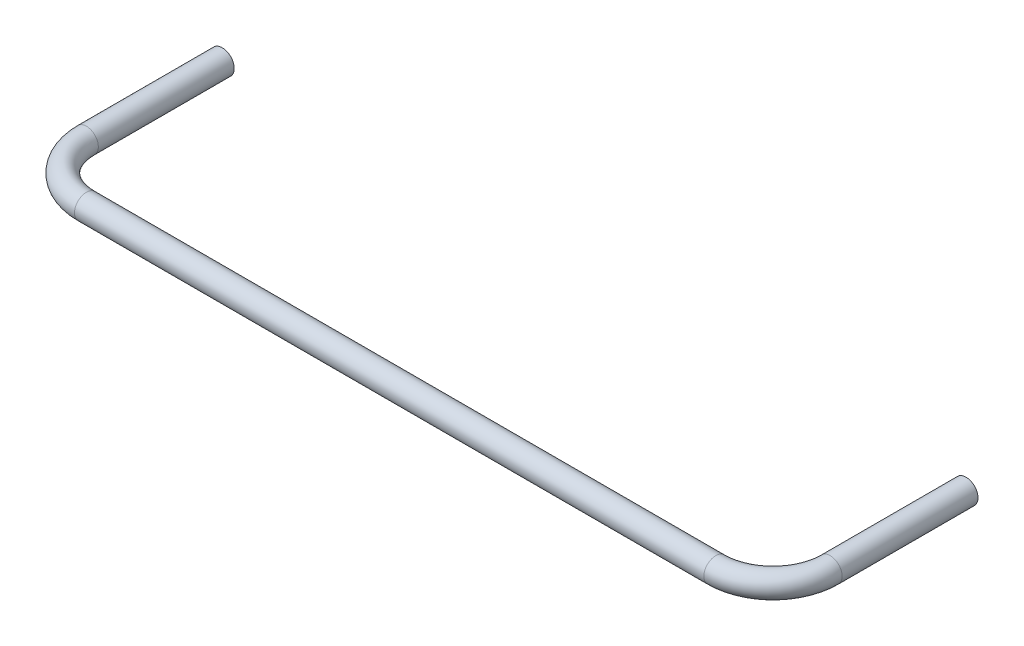
ISO-10303-21;
HEADER;
FILE_DESCRIPTION(('STEP AP214'),'2;1');
FILE_NAME('part.step','',(''),(''),'','','');
FILE_SCHEMA(('AUTOMOTIVE_DESIGN { 1 0 10303 214 1 1 1 1 }'));
ENDSEC;
DATA;
#1=APPLICATION_CONTEXT('core data for automotive mechanical design processes');
#2=APPLICATION_PROTOCOL_DEFINITION('international standard','automotive_design',2000,#1);
#3=PRODUCT_CONTEXT('',#1,'mechanical');
#4=PRODUCT('Part','Part','',(#3));
#5=PRODUCT_RELATED_PRODUCT_CATEGORY('part','',(#4));
#6=PRODUCT_DEFINITION_FORMATION('','',#4);
#7=PRODUCT_DEFINITION_CONTEXT('part definition',#1,'design');
#8=PRODUCT_DEFINITION('design','',#6,#7);
#9=PRODUCT_DEFINITION_SHAPE('','',#8);
#10=(LENGTH_UNIT() NAMED_UNIT(*) SI_UNIT(.MILLI.,.METRE.));
#11=(NAMED_UNIT(*) PLANE_ANGLE_UNIT() SI_UNIT($,.RADIAN.));
#12=(NAMED_UNIT(*) SI_UNIT($,.STERADIAN.) SOLID_ANGLE_UNIT());
#13=UNCERTAINTY_MEASURE_WITH_UNIT(LENGTH_MEASURE(1.E-05),#10,'distance_accuracy_value','');
#14=(GEOMETRIC_REPRESENTATION_CONTEXT(3) GLOBAL_UNCERTAINTY_ASSIGNED_CONTEXT((#13)) GLOBAL_UNIT_ASSIGNED_CONTEXT((#10,
#11,#12)) REPRESENTATION_CONTEXT('',''));
#15=CARTESIAN_POINT('',(0.,0.,0.));
#16=DIRECTION('',(0.,0.,1.));
#17=DIRECTION('',(1.,0.,0.));
#18=AXIS2_PLACEMENT_3D('',#15,#16,#17);
#19=CARTESIAN_POINT('',(260.025,0.,0.));
#20=DIRECTION('',(0.,0.,1.));
#21=DIRECTION('',(1.,0.,0.));
#22=AXIS2_PLACEMENT_3D('',#19,#20,#21);
#23=PLANE('',#22);
#24=CARTESIAN_POINT('',(260.025,0.,0.));
#25=DIRECTION('',(0.,0.,1.));
#26=DIRECTION('',(1.,0.,0.));
#27=AXIS2_PLACEMENT_3D('',#24,#25,#26);
#28=CIRCLE('',#27,8.35000000000005);
#29=CARTESIAN_POINT('',(268.375,0.,0.));
#30=VERTEX_POINT('',#29);
#31=EDGE_CURVE('E56',#30,#30,#28,.T.);
#32=ORIENTED_EDGE('',*,*,#31,.F.);
#33=EDGE_LOOP('',(#32));
#34=FACE_BOUND('',#33,.T.);
#35=ADVANCED_FACE('F34',(#34),#23,.F.);
#36=CARTESIAN_POINT('',(-260.025,0.,0.));
#37=DIRECTION('',(0.,0.,-1.));
#38=DIRECTION('',(-1.,0.,0.));
#39=AXIS2_PLACEMENT_3D('',#36,#37,#38);
#40=PLANE('',#39);
#41=CARTESIAN_POINT('',(-260.025,0.,0.));
#42=DIRECTION('',(0.,0.,-1.));
#43=DIRECTION('',(-1.,0.,0.));
#44=AXIS2_PLACEMENT_3D('',#41,#42,#43);
#45=CIRCLE('',#44,8.35000000000005);
#46=CARTESIAN_POINT('',(-268.375,0.,0.));
#47=VERTEX_POINT('',#46);
#48=EDGE_CURVE('E10',#47,#47,#45,.T.);
#49=ORIENTED_EDGE('',*,*,#48,.T.);
#50=EDGE_LOOP('',(#49));
#51=FACE_BOUND('',#50,.T.);
#52=ADVANCED_FACE('F63',(#51),#40,.T.);
#53=CARTESIAN_POINT('',(260.025,0.,0.));
#54=DIRECTION('',(0.,0.,1.));
#55=DIRECTION('',(1.,0.,0.));
#56=AXIS2_PLACEMENT_3D('',#53,#54,#55);
#57=CYLINDRICAL_SURFACE('',#56,8.35000000000005);
#58=CARTESIAN_POINT('',(260.025,0.,94.9999999999997));
#59=DIRECTION('',(0.,0.,1.));
#60=DIRECTION('',(1.,0.,0.));
#61=AXIS2_PLACEMENT_3D('',#58,#59,#60);
#62=CIRCLE('',#61,8.35000000000005);
#63=CARTESIAN_POINT('',(268.375,0.,94.9999999999997));
#64=VERTEX_POINT('',#63);
#65=EDGE_CURVE('E53',#64,#64,#62,.T.);
#66=ORIENTED_EDGE('',*,*,#65,.F.);
#67=EDGE_LOOP('',(#66));
#68=FACE_BOUND('',#67,.T.);
#69=ORIENTED_EDGE('',*,*,#31,.T.);
#70=EDGE_LOOP('',(#69));
#71=FACE_BOUND('',#70,.T.);
#72=ADVANCED_FACE('F60',(#68,#71),#57,.T.);
#73=CARTESIAN_POINT('',(220.025,0.,95.));
#74=DIRECTION('',(0.,-1.,0.));
#75=DIRECTION('',(0.,0.,-1.));
#76=AXIS2_PLACEMENT_3D('',#73,#74,#75);
#77=TOROIDAL_SURFACE('',#76,40.,8.35000000000005);
#78=CARTESIAN_POINT('',(220.025,0.,135.));
#79=DIRECTION('',(-1.,0.,0.));
#80=DIRECTION('',(0.,0.,1.));
#81=AXIS2_PLACEMENT_3D('',#78,#79,#80);
#82=CIRCLE('',#81,8.35000000000005);
#83=CARTESIAN_POINT('',(220.025,0.,143.35));
#84=VERTEX_POINT('',#83);
#85=EDGE_CURVE('E48',#84,#84,#82,.T.);
#86=CARTESIAN_POINT('',(220.025,0.,95.));
#87=DIRECTION('',(0.,-1.,0.));
#88=DIRECTION('',(0.,0.,-1.));
#89=AXIS2_PLACEMENT_3D('',#86,#87,#88);
#90=CIRCLE('',#89,48.35);
#91=EDGE_CURVE('',#64,#84,#90,.T.);
#92=ORIENTED_EDGE('',*,*,#65,.T.);
#93=ORIENTED_EDGE('',*,*,#85,.F.);
#94=ORIENTED_EDGE('',*,*,#91,.T.);
#95=ORIENTED_EDGE('',*,*,#91,.F.);
#96=EDGE_LOOP('',(#92,#94,#93,#95));
#97=FACE_BOUND('',#96,.T.);
#98=ADVANCED_FACE('F81',(#97),#77,.T.);
#99=CARTESIAN_POINT('',(220.025,0.,135.));
#100=DIRECTION('',(-1.,0.,0.));
#101=DIRECTION('',(0.,0.,1.));
#102=AXIS2_PLACEMENT_3D('',#99,#100,#101);
#103=CYLINDRICAL_SURFACE('',#102,8.35000000000005);
#104=CARTESIAN_POINT('',(-220.025,0.,135.));
#105=DIRECTION('',(-1.,0.,0.));
#106=DIRECTION('',(0.,0.,1.));
#107=AXIS2_PLACEMENT_3D('',#104,#105,#106);
#108=CIRCLE('',#107,8.35000000000005);
#109=CARTESIAN_POINT('',(-220.025,0.,143.35));
#110=VERTEX_POINT('',#109);
#111=EDGE_CURVE('E44',#110,#110,#108,.T.);
#112=ORIENTED_EDGE('',*,*,#111,.F.);
#113=EDGE_LOOP('',(#112));
#114=FACE_BOUND('',#113,.T.);
#115=ORIENTED_EDGE('',*,*,#85,.T.);
#116=EDGE_LOOP('',(#115));
#117=FACE_BOUND('',#116,.T.);
#118=ADVANCED_FACE('F75',(#114,#117),#103,.T.);
#119=CARTESIAN_POINT('',(-220.025,0.,95.));
#120=DIRECTION('',(0.,-1.,0.));
#121=DIRECTION('',(0.,0.,-1.));
#122=AXIS2_PLACEMENT_3D('',#119,#120,#121);
#123=TOROIDAL_SURFACE('',#122,40.,8.35000000000005);
#124=CARTESIAN_POINT('',(-260.025,0.,94.9999999999997));
#125=DIRECTION('',(0.,0.,-1.));
#126=DIRECTION('',(-1.,0.,0.));
#127=AXIS2_PLACEMENT_3D('',#124,#125,#126);
#128=CIRCLE('',#127,8.35000000000005);
#129=CARTESIAN_POINT('',(-268.375,0.,94.9999999999997));
#130=VERTEX_POINT('',#129);
#131=EDGE_CURVE('E40',#130,#130,#128,.T.);
#132=CARTESIAN_POINT('',(-220.025,0.,95.));
#133=DIRECTION('',(0.,-1.,0.));
#134=DIRECTION('',(0.,0.,-1.));
#135=AXIS2_PLACEMENT_3D('',#132,#133,#134);
#136=CIRCLE('',#135,48.3500000000001);
#137=EDGE_CURVE('',#110,#130,#136,.T.);
#138=ORIENTED_EDGE('',*,*,#111,.T.);
#139=ORIENTED_EDGE('',*,*,#131,.F.);
#140=ORIENTED_EDGE('',*,*,#137,.T.);
#141=ORIENTED_EDGE('',*,*,#137,.F.);
#142=EDGE_LOOP('',(#138,#140,#139,#141));
#143=FACE_BOUND('',#142,.T.);
#144=ADVANCED_FACE('F69',(#143),#123,.T.);
#145=CARTESIAN_POINT('',(-260.025,0.,94.9999999999997));
#146=DIRECTION('',(0.,0.,-1.));
#147=DIRECTION('',(-1.,0.,0.));
#148=AXIS2_PLACEMENT_3D('',#145,#146,#147);
#149=CYLINDRICAL_SURFACE('',#148,8.35000000000005);
#150=ORIENTED_EDGE('',*,*,#48,.F.);
#151=EDGE_LOOP('',(#150));
#152=FACE_BOUND('',#151,.T.);
#153=ORIENTED_EDGE('',*,*,#131,.T.);
#154=EDGE_LOOP('',(#153));
#155=FACE_BOUND('',#154,.T.);
#156=ADVANCED_FACE('F67',(#152,#155),#149,.T.);
#157=CLOSED_SHELL('',(#35,#52,#72,#98,#118,#144,#156));
#158=MANIFOLD_SOLID_BREP('B2',#157);
#159=ADVANCED_BREP_SHAPE_REPRESENTATION('',(#18,#158),#14);
#160=SHAPE_DEFINITION_REPRESENTATION(#9,#159);
ENDSEC;
END-ISO-10303-21;
